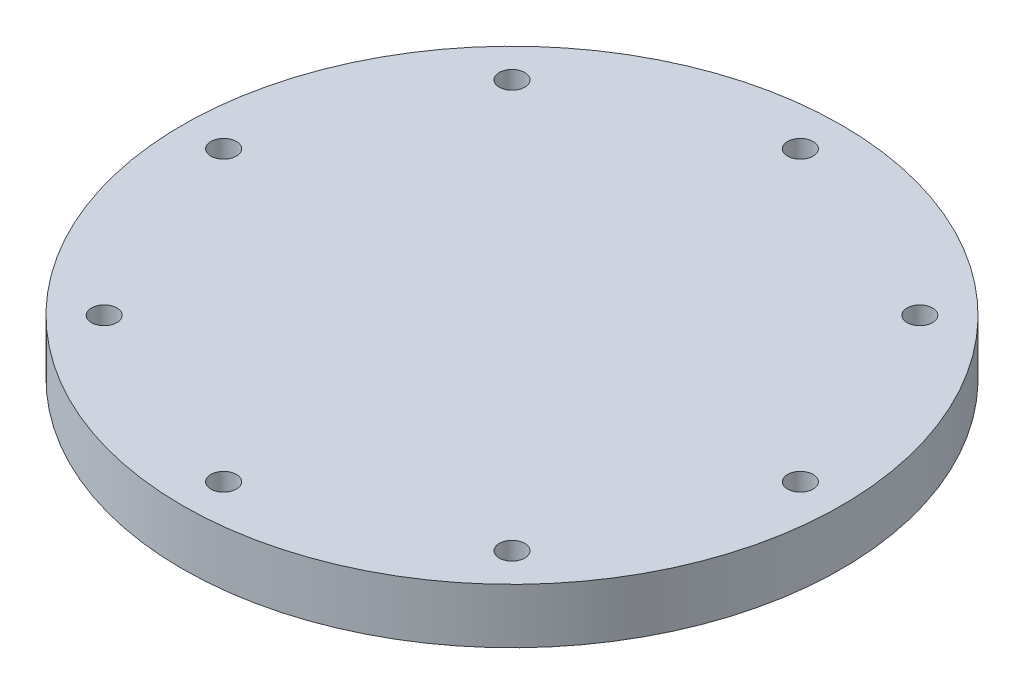
ISO-10303-21;
HEADER;
FILE_DESCRIPTION(('STEP AP214'),'2;1');
FILE_NAME('part.step','',(''),(''),'','','');
FILE_SCHEMA(('AUTOMOTIVE_DESIGN { 1 0 10303 214 1 1 1 1 }'));
ENDSEC;
DATA;
#1=APPLICATION_CONTEXT('core data for automotive mechanical design processes');
#2=APPLICATION_PROTOCOL_DEFINITION('international standard','automotive_design',2000,#1);
#3=PRODUCT_CONTEXT('',#1,'mechanical');
#4=PRODUCT('Part','Part','',(#3));
#5=PRODUCT_RELATED_PRODUCT_CATEGORY('part','',(#4));
#6=PRODUCT_DEFINITION_FORMATION('','',#4);
#7=PRODUCT_DEFINITION_CONTEXT('part definition',#1,'design');
#8=PRODUCT_DEFINITION('design','',#6,#7);
#9=PRODUCT_DEFINITION_SHAPE('','',#8);
#10=(LENGTH_UNIT() NAMED_UNIT(*) SI_UNIT(.MILLI.,.METRE.));
#11=(NAMED_UNIT(*) PLANE_ANGLE_UNIT() SI_UNIT($,.RADIAN.));
#12=(NAMED_UNIT(*) SI_UNIT($,.STERADIAN.) SOLID_ANGLE_UNIT());
#13=UNCERTAINTY_MEASURE_WITH_UNIT(LENGTH_MEASURE(1.E-05),#10,'distance_accuracy_value','');
#14=(GEOMETRIC_REPRESENTATION_CONTEXT(3) GLOBAL_UNCERTAINTY_ASSIGNED_CONTEXT((#13)) GLOBAL_UNIT_ASSIGNED_CONTEXT((#10,
#11,#12)) REPRESENTATION_CONTEXT('',''));
#15=CARTESIAN_POINT('',(0.,0.,0.));
#16=DIRECTION('',(0.,0.,1.));
#17=DIRECTION('',(1.,0.,0.));
#18=AXIS2_PLACEMENT_3D('',#15,#16,#17);
#19=CARTESIAN_POINT('',(0.,0.,0.));
#20=DIRECTION('',(0.,1.,0.));
#21=DIRECTION('',(0.,0.,1.));
#22=AXIS2_PLACEMENT_3D('',#19,#20,#21);
#23=PLANE('',#22);
#24=CARTESIAN_POINT('',(-23.5731723178062,0.,23.5731723178068));
#25=DIRECTION('',(0.,-1.,0.));
#26=DIRECTION('',(0.,0.,-1.));
#27=AXIS2_PLACEMENT_3D('',#24,#25,#26);
#28=CIRCLE('',#27,2.413);
#29=CARTESIAN_POINT('',(-23.5731723178062,0.,21.1601723178068));
#30=VERTEX_POINT('',#29);
#31=EDGE_CURVE('E136',#30,#30,#28,.T.);
#32=ORIENTED_EDGE('',*,*,#31,.F.);
#33=EDGE_LOOP('',(#32));
#34=FACE_BOUND('',#33,.T.);
#35=CARTESIAN_POINT('',(-33.3375,0.,3.49191777401049E-13));
#36=DIRECTION('',(0.,-1.,0.));
#37=DIRECTION('',(0.,0.,-1.));
#38=AXIS2_PLACEMENT_3D('',#35,#36,#37);
#39=CIRCLE('',#38,2.413);
#40=CARTESIAN_POINT('',(-33.3375,0.,-2.41299999999965));
#41=VERTEX_POINT('',#40);
#42=EDGE_CURVE('E124',#41,#41,#39,.T.);
#43=ORIENTED_EDGE('',*,*,#42,.F.);
#44=EDGE_LOOP('',(#43));
#45=FACE_BOUND('',#44,.T.);
#46=CARTESIAN_POINT('',(-23.5731723178067,0.,-23.5731723178063));
#47=DIRECTION('',(0.,-1.,0.));
#48=DIRECTION('',(0.,0.,-1.));
#49=AXIS2_PLACEMENT_3D('',#46,#47,#48);
#50=CIRCLE('',#49,2.413);
#51=CARTESIAN_POINT('',(-23.5731723178067,0.,-25.9861723178063));
#52=VERTEX_POINT('',#51);
#53=EDGE_CURVE('E112',#52,#52,#50,.T.);
#54=ORIENTED_EDGE('',*,*,#53,.F.);
#55=EDGE_LOOP('',(#54));
#56=FACE_BOUND('',#55,.T.);
#57=CARTESIAN_POINT('',(0.,0.,-33.3375));
#58=DIRECTION('',(0.,-1.,0.));
#59=DIRECTION('',(0.,0.,-1.));
#60=AXIS2_PLACEMENT_3D('',#57,#58,#59);
#61=CIRCLE('',#60,2.413);
#62=CARTESIAN_POINT('',(0.,0.,-35.7505));
#63=VERTEX_POINT('',#62);
#64=EDGE_CURVE('E100',#63,#63,#61,.T.);
#65=ORIENTED_EDGE('',*,*,#64,.F.);
#66=EDGE_LOOP('',(#65));
#67=FACE_BOUND('',#66,.T.);
#68=CARTESIAN_POINT('',(23.5731723178064,0.,-23.5731723178067));
#69=DIRECTION('',(0.,-1.,0.));
#70=DIRECTION('',(0.,0.,-1.));
#71=AXIS2_PLACEMENT_3D('',#68,#69,#70);
#72=CIRCLE('',#71,2.413);
#73=CARTESIAN_POINT('',(23.5731723178064,0.,-25.9861723178067));
#74=VERTEX_POINT('',#73);
#75=EDGE_CURVE('E88',#74,#74,#72,.T.);
#76=ORIENTED_EDGE('',*,*,#75,.F.);
#77=EDGE_LOOP('',(#76));
#78=FACE_BOUND('',#77,.T.);
#79=CARTESIAN_POINT('',(23.5731723178066,0.,23.5731723178065));
#80=DIRECTION('',(0.,-1.,0.));
#81=DIRECTION('',(0.,0.,-1.));
#82=AXIS2_PLACEMENT_3D('',#79,#80,#81);
#83=CIRCLE('',#82,2.413);
#84=CARTESIAN_POINT('',(23.5731723178066,0.,21.1601723178065));
#85=VERTEX_POINT('',#84);
#86=EDGE_CURVE('E64',#85,#85,#83,.T.);
#87=ORIENTED_EDGE('',*,*,#86,.F.);
#88=EDGE_LOOP('',(#87));
#89=FACE_BOUND('',#88,.T.);
#90=CARTESIAN_POINT('',(0.,0.,33.3375));
#91=DIRECTION('',(0.,-1.,0.));
#92=DIRECTION('',(0.,0.,-1.));
#93=AXIS2_PLACEMENT_3D('',#90,#91,#92);
#94=CIRCLE('',#93,2.413);
#95=CARTESIAN_POINT('',(0.,0.,30.9245));
#96=VERTEX_POINT('',#95);
#97=EDGE_CURVE('E52',#96,#96,#94,.T.);
#98=ORIENTED_EDGE('',*,*,#97,.F.);
#99=EDGE_LOOP('',(#98));
#100=FACE_BOUND('',#99,.T.);
#101=CARTESIAN_POINT('',(0.,0.,0.));
#102=DIRECTION('',(0.,1.,0.));
#103=DIRECTION('',(0.,0.,1.));
#104=AXIS2_PLACEMENT_3D('',#101,#102,#103);
#105=CIRCLE('',#104,38.1);
#106=CARTESIAN_POINT('',(0.,0.,38.1));
#107=VERTEX_POINT('',#106);
#108=EDGE_CURVE('E35',#107,#107,#105,.T.);
#109=ORIENTED_EDGE('',*,*,#108,.F.);
#110=EDGE_LOOP('',(#109));
#111=FACE_BOUND('',#110,.T.);
#112=CARTESIAN_POINT('',(33.3375,0.,-1.16397259133683E-13));
#113=DIRECTION('',(0.,-1.,0.));
#114=DIRECTION('',(0.,0.,-1.));
#115=AXIS2_PLACEMENT_3D('',#112,#113,#114);
#116=CIRCLE('',#115,2.413);
#117=CARTESIAN_POINT('',(33.3375,0.,-2.41300000000011));
#118=VERTEX_POINT('',#117);
#119=EDGE_CURVE('E76',#118,#118,#116,.T.);
#120=ORIENTED_EDGE('',*,*,#119,.F.);
#121=EDGE_LOOP('',(#120));
#122=FACE_BOUND('',#121,.T.);
#123=ADVANCED_FACE('F31',(#34,#45,#56,#67,#78,#89,#100,#111,#122),#23,.F.);
#124=CARTESIAN_POINT('',(0.,6.35,0.));
#125=DIRECTION('',(0.,-1.,0.));
#126=DIRECTION('',(0.,0.,-1.));
#127=AXIS2_PLACEMENT_3D('',#124,#125,#126);
#128=CYLINDRICAL_SURFACE('',#127,38.1);
#129=CARTESIAN_POINT('',(0.,6.35,0.));
#130=DIRECTION('',(0.,1.,0.));
#131=DIRECTION('',(0.,0.,1.));
#132=AXIS2_PLACEMENT_3D('',#129,#130,#131);
#133=CIRCLE('',#132,38.1);
#134=CARTESIAN_POINT('',(0.,6.35,38.1));
#135=VERTEX_POINT('',#134);
#136=EDGE_CURVE('E10',#135,#135,#133,.T.);
#137=ORIENTED_EDGE('',*,*,#136,.F.);
#138=EDGE_LOOP('',(#137));
#139=FACE_BOUND('',#138,.T.);
#140=ORIENTED_EDGE('',*,*,#108,.T.);
#141=EDGE_LOOP('',(#140));
#142=FACE_BOUND('',#141,.T.);
#143=ADVANCED_FACE('F33',(#139,#142),#128,.T.);
#144=CARTESIAN_POINT('',(0.,6.35,0.));
#145=DIRECTION('',(0.,1.,0.));
#146=DIRECTION('',(0.,0.,1.));
#147=AXIS2_PLACEMENT_3D('',#144,#145,#146);
#148=PLANE('',#147);
#149=CARTESIAN_POINT('',(-23.5731723178062,6.35,23.5731723178068));
#150=DIRECTION('',(0.,-1.,0.));
#151=DIRECTION('',(0.,0.,-1.));
#152=AXIS2_PLACEMENT_3D('',#149,#150,#151);
#153=CIRCLE('',#152,1.4732);
#154=CARTESIAN_POINT('',(-23.5731723178062,6.35,22.0999723178068));
#155=VERTEX_POINT('',#154);
#156=EDGE_CURVE('E127',#155,#155,#153,.T.);
#157=ORIENTED_EDGE('',*,*,#156,.T.);
#158=EDGE_LOOP('',(#157));
#159=FACE_BOUND('',#158,.T.);
#160=CARTESIAN_POINT('',(-33.3375,6.35,3.49191777401049E-13));
#161=DIRECTION('',(0.,-1.,0.));
#162=DIRECTION('',(0.,0.,-1.));
#163=AXIS2_PLACEMENT_3D('',#160,#161,#162);
#164=CIRCLE('',#163,1.4732);
#165=CARTESIAN_POINT('',(-33.3375,6.35,-1.47319999999965));
#166=VERTEX_POINT('',#165);
#167=EDGE_CURVE('E115',#166,#166,#164,.T.);
#168=ORIENTED_EDGE('',*,*,#167,.T.);
#169=EDGE_LOOP('',(#168));
#170=FACE_BOUND('',#169,.T.);
#171=CARTESIAN_POINT('',(-23.5731723178067,6.35,-23.5731723178063));
#172=DIRECTION('',(0.,-1.,0.));
#173=DIRECTION('',(0.,0.,-1.));
#174=AXIS2_PLACEMENT_3D('',#171,#172,#173);
#175=CIRCLE('',#174,1.4732);
#176=CARTESIAN_POINT('',(-23.5731723178067,6.35,-25.0463723178063));
#177=VERTEX_POINT('',#176);
#178=EDGE_CURVE('E103',#177,#177,#175,.T.);
#179=ORIENTED_EDGE('',*,*,#178,.T.);
#180=EDGE_LOOP('',(#179));
#181=FACE_BOUND('',#180,.T.);
#182=CARTESIAN_POINT('',(0.,6.35,-33.3375));
#183=DIRECTION('',(0.,-1.,0.));
#184=DIRECTION('',(0.,0.,-1.));
#185=AXIS2_PLACEMENT_3D('',#182,#183,#184);
#186=CIRCLE('',#185,1.4732);
#187=CARTESIAN_POINT('',(0.,6.35,-34.8107));
#188=VERTEX_POINT('',#187);
#189=EDGE_CURVE('E91',#188,#188,#186,.T.);
#190=ORIENTED_EDGE('',*,*,#189,.T.);
#191=EDGE_LOOP('',(#190));
#192=FACE_BOUND('',#191,.T.);
#193=CARTESIAN_POINT('',(23.5731723178064,6.35,-23.5731723178067));
#194=DIRECTION('',(0.,-1.,0.));
#195=DIRECTION('',(0.,0.,-1.));
#196=AXIS2_PLACEMENT_3D('',#193,#194,#195);
#197=CIRCLE('',#196,1.4732);
#198=CARTESIAN_POINT('',(23.5731723178064,6.35,-25.0463723178067));
#199=VERTEX_POINT('',#198);
#200=EDGE_CURVE('E79',#199,#199,#197,.T.);
#201=ORIENTED_EDGE('',*,*,#200,.T.);
#202=EDGE_LOOP('',(#201));
#203=FACE_BOUND('',#202,.T.);
#204=CARTESIAN_POINT('',(33.3375,6.35,-1.16397259133683E-13));
#205=DIRECTION('',(0.,-1.,0.));
#206=DIRECTION('',(0.,0.,-1.));
#207=AXIS2_PLACEMENT_3D('',#204,#205,#206);
#208=CIRCLE('',#207,1.4732);
#209=CARTESIAN_POINT('',(33.3375,6.35,-1.47320000000012));
#210=VERTEX_POINT('',#209);
#211=EDGE_CURVE('E67',#210,#210,#208,.T.);
#212=ORIENTED_EDGE('',*,*,#211,.T.);
#213=EDGE_LOOP('',(#212));
#214=FACE_BOUND('',#213,.T.);
#215=CARTESIAN_POINT('',(23.5731723178066,6.35,23.5731723178065));
#216=DIRECTION('',(0.,-1.,0.));
#217=DIRECTION('',(0.,0.,-1.));
#218=AXIS2_PLACEMENT_3D('',#215,#216,#217);
#219=CIRCLE('',#218,1.4732);
#220=CARTESIAN_POINT('',(23.5731723178066,6.35,22.0999723178065));
#221=VERTEX_POINT('',#220);
#222=EDGE_CURVE('E55',#221,#221,#219,.T.);
#223=ORIENTED_EDGE('',*,*,#222,.T.);
#224=EDGE_LOOP('',(#223));
#225=FACE_BOUND('',#224,.T.);
#226=CARTESIAN_POINT('',(0.,6.35,33.3375));
#227=DIRECTION('',(0.,-1.,0.));
#228=DIRECTION('',(0.,0.,-1.));
#229=AXIS2_PLACEMENT_3D('',#226,#227,#228);
#230=CIRCLE('',#229,1.4732);
#231=CARTESIAN_POINT('',(0.,6.35,31.8643));
#232=VERTEX_POINT('',#231);
#233=EDGE_CURVE('E42',#232,#232,#230,.T.);
#234=ORIENTED_EDGE('',*,*,#233,.T.);
#235=EDGE_LOOP('',(#234));
#236=FACE_BOUND('',#235,.T.);
#237=ORIENTED_EDGE('',*,*,#136,.T.);
#238=EDGE_LOOP('',(#237));
#239=FACE_BOUND('',#238,.T.);
#240=ADVANCED_FACE('F205',(#159,#170,#181,#192,#203,#214,#225,#236,#239),#148,.T.);
#241=CARTESIAN_POINT('',(0.,0.,33.3375));
#242=DIRECTION('',(0.,-1.,0.));
#243=DIRECTION('',(0.,0.,-1.));
#244=AXIS2_PLACEMENT_3D('',#241,#242,#243);
#245=CYLINDRICAL_SURFACE('',#244,1.4732);
#246=ORIENTED_EDGE('',*,*,#233,.F.);
#247=EDGE_LOOP('',(#246));
#248=FACE_BOUND('',#247,.T.);
#249=CARTESIAN_POINT('',(0.,2.8448,33.3375));
#250=DIRECTION('',(0.,-1.,0.));
#251=DIRECTION('',(0.,0.,-1.));
#252=AXIS2_PLACEMENT_3D('',#249,#250,#251);
#253=CIRCLE('',#252,1.4732);
#254=CARTESIAN_POINT('',(0.,2.8448,31.8643));
#255=VERTEX_POINT('',#254);
#256=EDGE_CURVE('E46',#255,#255,#253,.T.);
#257=ORIENTED_EDGE('',*,*,#256,.T.);
#258=EDGE_LOOP('',(#257));
#259=FACE_BOUND('',#258,.T.);
#260=ADVANCED_FACE('F201',(#248,#259),#245,.F.);
#261=CARTESIAN_POINT('',(1.4732,2.8448,33.3375));
#262=DIRECTION('',(0.,1.,0.));
#263=DIRECTION('',(0.,0.,1.));
#264=AXIS2_PLACEMENT_3D('',#261,#262,#263);
#265=PLANE('',#264);
#266=ORIENTED_EDGE('',*,*,#256,.F.);
#267=EDGE_LOOP('',(#266));
#268=FACE_BOUND('',#267,.T.);
#269=CARTESIAN_POINT('',(0.,2.8448,33.3375));
#270=DIRECTION('',(0.,-1.,0.));
#271=DIRECTION('',(0.,0.,-1.));
#272=AXIS2_PLACEMENT_3D('',#269,#270,#271);
#273=CIRCLE('',#272,2.413);
#274=CARTESIAN_POINT('',(0.,2.8448,30.9245));
#275=VERTEX_POINT('',#274);
#276=EDGE_CURVE('E49',#275,#275,#273,.T.);
#277=ORIENTED_EDGE('',*,*,#276,.T.);
#278=EDGE_LOOP('',(#277));
#279=FACE_BOUND('',#278,.T.);
#280=ADVANCED_FACE('F197',(#268,#279),#265,.F.);
#281=CARTESIAN_POINT('',(0.,0.,33.3375));
#282=DIRECTION('',(0.,-1.,0.));
#283=DIRECTION('',(0.,0.,-1.));
#284=AXIS2_PLACEMENT_3D('',#281,#282,#283);
#285=CYLINDRICAL_SURFACE('',#284,2.413);
#286=ORIENTED_EDGE('',*,*,#276,.F.);
#287=EDGE_LOOP('',(#286));
#288=FACE_BOUND('',#287,.T.);
#289=ORIENTED_EDGE('',*,*,#97,.T.);
#290=EDGE_LOOP('',(#289));
#291=FACE_BOUND('',#290,.T.);
#292=ADVANCED_FACE('F193',(#288,#291),#285,.F.);
#293=CARTESIAN_POINT('',(23.5731723178066,0.,23.5731723178065));
#294=DIRECTION('',(0.,-1.,0.));
#295=DIRECTION('',(0.,0.,-1.));
#296=AXIS2_PLACEMENT_3D('',#293,#294,#295);
#297=CYLINDRICAL_SURFACE('',#296,1.4732);
#298=ORIENTED_EDGE('',*,*,#222,.F.);
#299=EDGE_LOOP('',(#298));
#300=FACE_BOUND('',#299,.T.);
#301=CARTESIAN_POINT('',(23.5731723178066,2.8448,23.5731723178065));
#302=DIRECTION('',(0.,-1.,0.));
#303=DIRECTION('',(0.,0.,-1.));
#304=AXIS2_PLACEMENT_3D('',#301,#302,#303);
#305=CIRCLE('',#304,1.4732);
#306=CARTESIAN_POINT('',(23.5731723178066,2.8448,22.0999723178065));
#307=VERTEX_POINT('',#306);
#308=EDGE_CURVE('E58',#307,#307,#305,.T.);
#309=ORIENTED_EDGE('',*,*,#308,.T.);
#310=EDGE_LOOP('',(#309));
#311=FACE_BOUND('',#310,.T.);
#312=ADVANCED_FACE('F189',(#300,#311),#297,.F.);
#313=CARTESIAN_POINT('',(25.0463723178066,2.8448,23.5731723178065));
#314=DIRECTION('',(0.,1.,0.));
#315=DIRECTION('',(0.,0.,1.));
#316=AXIS2_PLACEMENT_3D('',#313,#314,#315);
#317=PLANE('',#316);
#318=ORIENTED_EDGE('',*,*,#308,.F.);
#319=EDGE_LOOP('',(#318));
#320=FACE_BOUND('',#319,.T.);
#321=CARTESIAN_POINT('',(23.5731723178066,2.8448,23.5731723178065));
#322=DIRECTION('',(0.,-1.,0.));
#323=DIRECTION('',(0.,0.,-1.));
#324=AXIS2_PLACEMENT_3D('',#321,#322,#323);
#325=CIRCLE('',#324,2.413);
#326=CARTESIAN_POINT('',(23.5731723178066,2.8448,21.1601723178065));
#327=VERTEX_POINT('',#326);
#328=EDGE_CURVE('E61',#327,#327,#325,.T.);
#329=ORIENTED_EDGE('',*,*,#328,.T.);
#330=EDGE_LOOP('',(#329));
#331=FACE_BOUND('',#330,.T.);
#332=ADVANCED_FACE('F185',(#320,#331),#317,.F.);
#333=CARTESIAN_POINT('',(23.5731723178066,0.,23.5731723178065));
#334=DIRECTION('',(0.,-1.,0.));
#335=DIRECTION('',(0.,0.,-1.));
#336=AXIS2_PLACEMENT_3D('',#333,#334,#335);
#337=CYLINDRICAL_SURFACE('',#336,2.413);
#338=ORIENTED_EDGE('',*,*,#328,.F.);
#339=EDGE_LOOP('',(#338));
#340=FACE_BOUND('',#339,.T.);
#341=ORIENTED_EDGE('',*,*,#86,.T.);
#342=EDGE_LOOP('',(#341));
#343=FACE_BOUND('',#342,.T.);
#344=ADVANCED_FACE('F181',(#340,#343),#337,.F.);
#345=CARTESIAN_POINT('',(33.3375,0.,-1.16397259133683E-13));
#346=DIRECTION('',(0.,-1.,0.));
#347=DIRECTION('',(0.,0.,-1.));
#348=AXIS2_PLACEMENT_3D('',#345,#346,#347);
#349=CYLINDRICAL_SURFACE('',#348,1.4732);
#350=ORIENTED_EDGE('',*,*,#211,.F.);
#351=EDGE_LOOP('',(#350));
#352=FACE_BOUND('',#351,.T.);
#353=CARTESIAN_POINT('',(33.3375,2.8448,-1.16397259133683E-13));
#354=DIRECTION('',(0.,-1.,0.));
#355=DIRECTION('',(0.,0.,-1.));
#356=AXIS2_PLACEMENT_3D('',#353,#354,#355);
#357=CIRCLE('',#356,1.4732);
#358=CARTESIAN_POINT('',(33.3375,2.8448,-1.47320000000012));
#359=VERTEX_POINT('',#358);
#360=EDGE_CURVE('E70',#359,#359,#357,.T.);
#361=ORIENTED_EDGE('',*,*,#360,.T.);
#362=EDGE_LOOP('',(#361));
#363=FACE_BOUND('',#362,.T.);
#364=ADVANCED_FACE('F173',(#352,#363),#349,.F.);
#365=CARTESIAN_POINT('',(34.8107,2.8448,-1.16397259133683E-13));
#366=DIRECTION('',(0.,1.,0.));
#367=DIRECTION('',(0.,0.,1.));
#368=AXIS2_PLACEMENT_3D('',#365,#366,#367);
#369=PLANE('',#368);
#370=ORIENTED_EDGE('',*,*,#360,.F.);
#371=EDGE_LOOP('',(#370));
#372=FACE_BOUND('',#371,.T.);
#373=CARTESIAN_POINT('',(33.3375,2.8448,-1.16397259133683E-13));
#374=DIRECTION('',(0.,-1.,0.));
#375=DIRECTION('',(0.,0.,-1.));
#376=AXIS2_PLACEMENT_3D('',#373,#374,#375);
#377=CIRCLE('',#376,2.413);
#378=CARTESIAN_POINT('',(33.3375,2.8448,-2.41300000000011));
#379=VERTEX_POINT('',#378);
#380=EDGE_CURVE('E73',#379,#379,#377,.T.);
#381=ORIENTED_EDGE('',*,*,#380,.T.);
#382=EDGE_LOOP('',(#381));
#383=FACE_BOUND('',#382,.T.);
#384=ADVANCED_FACE('F163',(#372,#383),#369,.F.);
#385=CARTESIAN_POINT('',(33.3375,0.,-1.16397259133683E-13));
#386=DIRECTION('',(0.,-1.,0.));
#387=DIRECTION('',(0.,0.,-1.));
#388=AXIS2_PLACEMENT_3D('',#385,#386,#387);
#389=CYLINDRICAL_SURFACE('',#388,2.413);
#390=ORIENTED_EDGE('',*,*,#380,.F.);
#391=EDGE_LOOP('',(#390));
#392=FACE_BOUND('',#391,.T.);
#393=ORIENTED_EDGE('',*,*,#119,.T.);
#394=EDGE_LOOP('',(#393));
#395=FACE_BOUND('',#394,.T.);
#396=ADVANCED_FACE('F160',(#392,#395),#389,.F.);
#397=CARTESIAN_POINT('',(23.5731723178064,0.,-23.5731723178067));
#398=DIRECTION('',(0.,-1.,0.));
#399=DIRECTION('',(0.,0.,-1.));
#400=AXIS2_PLACEMENT_3D('',#397,#398,#399);
#401=CYLINDRICAL_SURFACE('',#400,1.4732);
#402=ORIENTED_EDGE('',*,*,#200,.F.);
#403=EDGE_LOOP('',(#402));
#404=FACE_BOUND('',#403,.T.);
#405=CARTESIAN_POINT('',(23.5731723178064,2.8448,-23.5731723178067));
#406=DIRECTION('',(0.,-1.,0.));
#407=DIRECTION('',(0.,0.,-1.));
#408=AXIS2_PLACEMENT_3D('',#405,#406,#407);
#409=CIRCLE('',#408,1.4732);
#410=CARTESIAN_POINT('',(23.5731723178064,2.8448,-25.0463723178067));
#411=VERTEX_POINT('',#410);
#412=EDGE_CURVE('E82',#411,#411,#409,.T.);
#413=ORIENTED_EDGE('',*,*,#412,.T.);
#414=EDGE_LOOP('',(#413));
#415=FACE_BOUND('',#414,.T.);
#416=ADVANCED_FACE('F162',(#404,#415),#401,.F.);
#417=CARTESIAN_POINT('',(25.0463723178064,2.8448,-23.5731723178067));
#418=DIRECTION('',(0.,1.,0.));
#419=DIRECTION('',(0.,0.,1.));
#420=AXIS2_PLACEMENT_3D('',#417,#418,#419);
#421=PLANE('',#420);
#422=ORIENTED_EDGE('',*,*,#412,.F.);
#423=EDGE_LOOP('',(#422));
#424=FACE_BOUND('',#423,.T.);
#425=CARTESIAN_POINT('',(23.5731723178064,2.8448,-23.5731723178067));
#426=DIRECTION('',(0.,-1.,0.));
#427=DIRECTION('',(0.,0.,-1.));
#428=AXIS2_PLACEMENT_3D('',#425,#426,#427);
#429=CIRCLE('',#428,2.413);
#430=CARTESIAN_POINT('',(23.5731723178064,2.8448,-25.9861723178067));
#431=VERTEX_POINT('',#430);
#432=EDGE_CURVE('E85',#431,#431,#429,.T.);
#433=ORIENTED_EDGE('',*,*,#432,.T.);
#434=EDGE_LOOP('',(#433));
#435=FACE_BOUND('',#434,.T.);
#436=ADVANCED_FACE('F170',(#424,#435),#421,.F.);
#437=CARTESIAN_POINT('',(23.5731723178064,0.,-23.5731723178067));
#438=DIRECTION('',(0.,-1.,0.));
#439=DIRECTION('',(0.,0.,-1.));
#440=AXIS2_PLACEMENT_3D('',#437,#438,#439);
#441=CYLINDRICAL_SURFACE('',#440,2.413);
#442=ORIENTED_EDGE('',*,*,#432,.F.);
#443=EDGE_LOOP('',(#442));
#444=FACE_BOUND('',#443,.T.);
#445=ORIENTED_EDGE('',*,*,#75,.T.);
#446=EDGE_LOOP('',(#445));
#447=FACE_BOUND('',#446,.T.);
#448=ADVANCED_FACE('F246',(#444,#447),#441,.F.);
#449=CARTESIAN_POINT('',(0.,0.,-33.3375));
#450=DIRECTION('',(0.,-1.,0.));
#451=DIRECTION('',(0.,0.,-1.));
#452=AXIS2_PLACEMENT_3D('',#449,#450,#451);
#453=CYLINDRICAL_SURFACE('',#452,1.4732);
#454=ORIENTED_EDGE('',*,*,#189,.F.);
#455=EDGE_LOOP('',(#454));
#456=FACE_BOUND('',#455,.T.);
#457=CARTESIAN_POINT('',(0.,2.8448,-33.3375));
#458=DIRECTION('',(0.,-1.,0.));
#459=DIRECTION('',(0.,0.,-1.));
#460=AXIS2_PLACEMENT_3D('',#457,#458,#459);
#461=CIRCLE('',#460,1.4732);
#462=CARTESIAN_POINT('',(0.,2.8448,-34.8107));
#463=VERTEX_POINT('',#462);
#464=EDGE_CURVE('E94',#463,#463,#461,.T.);
#465=ORIENTED_EDGE('',*,*,#464,.T.);
#466=EDGE_LOOP('',(#465));
#467=FACE_BOUND('',#466,.T.);
#468=ADVANCED_FACE('F251',(#456,#467),#453,.F.);
#469=CARTESIAN_POINT('',(1.4732,2.8448,-33.3375));
#470=DIRECTION('',(0.,1.,0.));
#471=DIRECTION('',(0.,0.,1.));
#472=AXIS2_PLACEMENT_3D('',#469,#470,#471);
#473=PLANE('',#472);
#474=ORIENTED_EDGE('',*,*,#464,.F.);
#475=EDGE_LOOP('',(#474));
#476=FACE_BOUND('',#475,.T.);
#477=CARTESIAN_POINT('',(0.,2.8448,-33.3375));
#478=DIRECTION('',(0.,-1.,0.));
#479=DIRECTION('',(0.,0.,-1.));
#480=AXIS2_PLACEMENT_3D('',#477,#478,#479);
#481=CIRCLE('',#480,2.413);
#482=CARTESIAN_POINT('',(0.,2.8448,-35.7505));
#483=VERTEX_POINT('',#482);
#484=EDGE_CURVE('E97',#483,#483,#481,.T.);
#485=ORIENTED_EDGE('',*,*,#484,.T.);
#486=EDGE_LOOP('',(#485));
#487=FACE_BOUND('',#486,.T.);
#488=ADVANCED_FACE('F256',(#476,#487),#473,.F.);
#489=CARTESIAN_POINT('',(0.,0.,-33.3375));
#490=DIRECTION('',(0.,-1.,0.));
#491=DIRECTION('',(0.,0.,-1.));
#492=AXIS2_PLACEMENT_3D('',#489,#490,#491);
#493=CYLINDRICAL_SURFACE('',#492,2.413);
#494=ORIENTED_EDGE('',*,*,#484,.F.);
#495=EDGE_LOOP('',(#494));
#496=FACE_BOUND('',#495,.T.);
#497=ORIENTED_EDGE('',*,*,#64,.T.);
#498=EDGE_LOOP('',(#497));
#499=FACE_BOUND('',#498,.T.);
#500=ADVANCED_FACE('F262',(#496,#499),#493,.F.);
#501=CARTESIAN_POINT('',(-23.5731723178067,0.,-23.5731723178063));
#502=DIRECTION('',(0.,-1.,0.));
#503=DIRECTION('',(0.,0.,-1.));
#504=AXIS2_PLACEMENT_3D('',#501,#502,#503);
#505=CYLINDRICAL_SURFACE('',#504,1.4732);
#506=ORIENTED_EDGE('',*,*,#178,.F.);
#507=EDGE_LOOP('',(#506));
#508=FACE_BOUND('',#507,.T.);
#509=CARTESIAN_POINT('',(-23.5731723178067,2.8448,-23.5731723178063));
#510=DIRECTION('',(0.,-1.,0.));
#511=DIRECTION('',(0.,0.,-1.));
#512=AXIS2_PLACEMENT_3D('',#509,#510,#511);
#513=CIRCLE('',#512,1.4732);
#514=CARTESIAN_POINT('',(-23.5731723178067,2.8448,-25.0463723178063));
#515=VERTEX_POINT('',#514);
#516=EDGE_CURVE('E106',#515,#515,#513,.T.);
#517=ORIENTED_EDGE('',*,*,#516,.T.);
#518=EDGE_LOOP('',(#517));
#519=FACE_BOUND('',#518,.T.);
#520=ADVANCED_FACE('F266',(#508,#519),#505,.F.);
#521=CARTESIAN_POINT('',(-22.0999723178067,2.8448,-23.5731723178063));
#522=DIRECTION('',(0.,1.,0.));
#523=DIRECTION('',(0.,0.,1.));
#524=AXIS2_PLACEMENT_3D('',#521,#522,#523);
#525=PLANE('',#524);
#526=ORIENTED_EDGE('',*,*,#516,.F.);
#527=EDGE_LOOP('',(#526));
#528=FACE_BOUND('',#527,.T.);
#529=CARTESIAN_POINT('',(-23.5731723178067,2.8448,-23.5731723178063));
#530=DIRECTION('',(0.,-1.,0.));
#531=DIRECTION('',(0.,0.,-1.));
#532=AXIS2_PLACEMENT_3D('',#529,#530,#531);
#533=CIRCLE('',#532,2.413);
#534=CARTESIAN_POINT('',(-23.5731723178067,2.8448,-25.9861723178063));
#535=VERTEX_POINT('',#534);
#536=EDGE_CURVE('E109',#535,#535,#533,.T.);
#537=ORIENTED_EDGE('',*,*,#536,.T.);
#538=EDGE_LOOP('',(#537));
#539=FACE_BOUND('',#538,.T.);
#540=ADVANCED_FACE('F270',(#528,#539),#525,.F.);
#541=CARTESIAN_POINT('',(-23.5731723178067,0.,-23.5731723178063));
#542=DIRECTION('',(0.,-1.,0.));
#543=DIRECTION('',(0.,0.,-1.));
#544=AXIS2_PLACEMENT_3D('',#541,#542,#543);
#545=CYLINDRICAL_SURFACE('',#544,2.413);
#546=ORIENTED_EDGE('',*,*,#536,.F.);
#547=EDGE_LOOP('',(#546));
#548=FACE_BOUND('',#547,.T.);
#549=ORIENTED_EDGE('',*,*,#53,.T.);
#550=EDGE_LOOP('',(#549));
#551=FACE_BOUND('',#550,.T.);
#552=ADVANCED_FACE('F274',(#548,#551),#545,.F.);
#553=CARTESIAN_POINT('',(-33.3375,0.,3.49191777401049E-13));
#554=DIRECTION('',(0.,-1.,0.));
#555=DIRECTION('',(0.,0.,-1.));
#556=AXIS2_PLACEMENT_3D('',#553,#554,#555);
#557=CYLINDRICAL_SURFACE('',#556,1.4732);
#558=ORIENTED_EDGE('',*,*,#167,.F.);
#559=EDGE_LOOP('',(#558));
#560=FACE_BOUND('',#559,.T.);
#561=CARTESIAN_POINT('',(-33.3375,2.8448,3.49191777401049E-13));
#562=DIRECTION('',(0.,-1.,0.));
#563=DIRECTION('',(0.,0.,-1.));
#564=AXIS2_PLACEMENT_3D('',#561,#562,#563);
#565=CIRCLE('',#564,1.4732);
#566=CARTESIAN_POINT('',(-33.3375,2.8448,-1.47319999999965));
#567=VERTEX_POINT('',#566);
#568=EDGE_CURVE('E118',#567,#567,#565,.T.);
#569=ORIENTED_EDGE('',*,*,#568,.T.);
#570=EDGE_LOOP('',(#569));
#571=FACE_BOUND('',#570,.T.);
#572=ADVANCED_FACE('F278',(#560,#571),#557,.F.);
#573=CARTESIAN_POINT('',(-31.8643,2.8448,3.49191777401049E-13));
#574=DIRECTION('',(0.,1.,0.));
#575=DIRECTION('',(0.,0.,1.));
#576=AXIS2_PLACEMENT_3D('',#573,#574,#575);
#577=PLANE('',#576);
#578=ORIENTED_EDGE('',*,*,#568,.F.);
#579=EDGE_LOOP('',(#578));
#580=FACE_BOUND('',#579,.T.);
#581=CARTESIAN_POINT('',(-33.3375,2.8448,3.49191777401049E-13));
#582=DIRECTION('',(0.,-1.,0.));
#583=DIRECTION('',(0.,0.,-1.));
#584=AXIS2_PLACEMENT_3D('',#581,#582,#583);
#585=CIRCLE('',#584,2.413);
#586=CARTESIAN_POINT('',(-33.3375,2.8448,-2.41299999999965));
#587=VERTEX_POINT('',#586);
#588=EDGE_CURVE('E121',#587,#587,#585,.T.);
#589=ORIENTED_EDGE('',*,*,#588,.T.);
#590=EDGE_LOOP('',(#589));
#591=FACE_BOUND('',#590,.T.);
#592=ADVANCED_FACE('F282',(#580,#591),#577,.F.);
#593=CARTESIAN_POINT('',(-33.3375,0.,3.49191777401049E-13));
#594=DIRECTION('',(0.,-1.,0.));
#595=DIRECTION('',(0.,0.,-1.));
#596=AXIS2_PLACEMENT_3D('',#593,#594,#595);
#597=CYLINDRICAL_SURFACE('',#596,2.413);
#598=ORIENTED_EDGE('',*,*,#588,.F.);
#599=EDGE_LOOP('',(#598));
#600=FACE_BOUND('',#599,.T.);
#601=ORIENTED_EDGE('',*,*,#42,.T.);
#602=EDGE_LOOP('',(#601));
#603=FACE_BOUND('',#602,.T.);
#604=ADVANCED_FACE('F286',(#600,#603),#597,.F.);
#605=CARTESIAN_POINT('',(-23.5731723178062,0.,23.5731723178068));
#606=DIRECTION('',(0.,-1.,0.));
#607=DIRECTION('',(0.,0.,-1.));
#608=AXIS2_PLACEMENT_3D('',#605,#606,#607);
#609=CYLINDRICAL_SURFACE('',#608,1.4732);
#610=ORIENTED_EDGE('',*,*,#156,.F.);
#611=EDGE_LOOP('',(#610));
#612=FACE_BOUND('',#611,.T.);
#613=CARTESIAN_POINT('',(-23.5731723178062,2.8448,23.5731723178068));
#614=DIRECTION('',(0.,-1.,0.));
#615=DIRECTION('',(0.,0.,-1.));
#616=AXIS2_PLACEMENT_3D('',#613,#614,#615);
#617=CIRCLE('',#616,1.4732);
#618=CARTESIAN_POINT('',(-23.5731723178062,2.8448,22.0999723178068));
#619=VERTEX_POINT('',#618);
#620=EDGE_CURVE('E130',#619,#619,#617,.T.);
#621=ORIENTED_EDGE('',*,*,#620,.T.);
#622=EDGE_LOOP('',(#621));
#623=FACE_BOUND('',#622,.T.);
#624=ADVANCED_FACE('F290',(#612,#623),#609,.F.);
#625=CARTESIAN_POINT('',(-22.0999723178062,2.8448,23.5731723178068));
#626=DIRECTION('',(0.,1.,0.));
#627=DIRECTION('',(0.,0.,1.));
#628=AXIS2_PLACEMENT_3D('',#625,#626,#627);
#629=PLANE('',#628);
#630=ORIENTED_EDGE('',*,*,#620,.F.);
#631=EDGE_LOOP('',(#630));
#632=FACE_BOUND('',#631,.T.);
#633=CARTESIAN_POINT('',(-23.5731723178062,2.8448,23.5731723178068));
#634=DIRECTION('',(0.,-1.,0.));
#635=DIRECTION('',(0.,0.,-1.));
#636=AXIS2_PLACEMENT_3D('',#633,#634,#635);
#637=CIRCLE('',#636,2.413);
#638=CARTESIAN_POINT('',(-23.5731723178062,2.8448,21.1601723178068));
#639=VERTEX_POINT('',#638);
#640=EDGE_CURVE('E133',#639,#639,#637,.T.);
#641=ORIENTED_EDGE('',*,*,#640,.T.);
#642=EDGE_LOOP('',(#641));
#643=FACE_BOUND('',#642,.T.);
#644=ADVANCED_FACE('F294',(#632,#643),#629,.F.);
#645=CARTESIAN_POINT('',(-23.5731723178062,0.,23.5731723178068));
#646=DIRECTION('',(0.,-1.,0.));
#647=DIRECTION('',(0.,0.,-1.));
#648=AXIS2_PLACEMENT_3D('',#645,#646,#647);
#649=CYLINDRICAL_SURFACE('',#648,2.413);
#650=ORIENTED_EDGE('',*,*,#640,.F.);
#651=EDGE_LOOP('',(#650));
#652=FACE_BOUND('',#651,.T.);
#653=ORIENTED_EDGE('',*,*,#31,.T.);
#654=EDGE_LOOP('',(#653));
#655=FACE_BOUND('',#654,.T.);
#656=ADVANCED_FACE('F140',(#652,#655),#649,.F.);
#657=CLOSED_SHELL('',(#123,#143,#240,#260,#280,#292,#312,#332,#344,#364,#384,#396,#416,#436,
#448,#468,#488,#500,#520,#540,#552,#572,#592,#604,#624,#644,#656));
#658=MANIFOLD_SOLID_BREP('B2',#657);
#659=ADVANCED_BREP_SHAPE_REPRESENTATION('',(#18,#658),#14);
#660=SHAPE_DEFINITION_REPRESENTATION(#9,#659);
ENDSEC;
END-ISO-10303-21;
